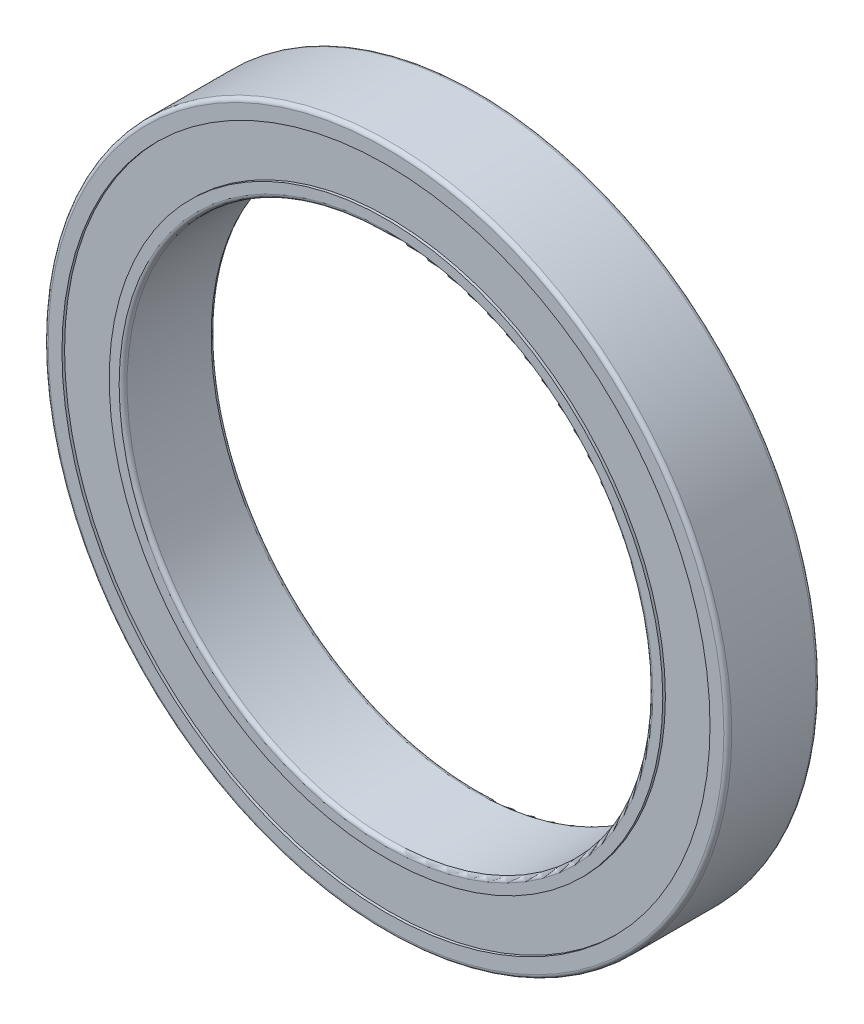
ISO-10303-21;
HEADER;
FILE_DESCRIPTION(('STEP AP214'),'2;1');
FILE_NAME('part.step','',(''),(''),'','','');
FILE_SCHEMA(('AUTOMOTIVE_DESIGN { 1 0 10303 214 1 1 1 1 }'));
ENDSEC;
DATA;
#1=APPLICATION_CONTEXT('core data for automotive mechanical design processes');
#2=APPLICATION_PROTOCOL_DEFINITION('international standard','automotive_design',2000,#1);
#3=PRODUCT_CONTEXT('',#1,'mechanical');
#4=PRODUCT('Part','Part','',(#3));
#5=PRODUCT_RELATED_PRODUCT_CATEGORY('part','',(#4));
#6=PRODUCT_DEFINITION_FORMATION('','',#4);
#7=PRODUCT_DEFINITION_CONTEXT('part definition',#1,'design');
#8=PRODUCT_DEFINITION('design','',#6,#7);
#9=PRODUCT_DEFINITION_SHAPE('','',#8);
#10=(LENGTH_UNIT() NAMED_UNIT(*) SI_UNIT(.MILLI.,.METRE.));
#11=(NAMED_UNIT(*) PLANE_ANGLE_UNIT() SI_UNIT($,.RADIAN.));
#12=(NAMED_UNIT(*) SI_UNIT($,.STERADIAN.) SOLID_ANGLE_UNIT());
#13=UNCERTAINTY_MEASURE_WITH_UNIT(LENGTH_MEASURE(1.E-05),#10,'distance_accuracy_value','');
#14=(GEOMETRIC_REPRESENTATION_CONTEXT(3) GLOBAL_UNCERTAINTY_ASSIGNED_CONTEXT((#13)) GLOBAL_UNIT_ASSIGNED_CONTEXT((#10,
#11,#12)) REPRESENTATION_CONTEXT('',''));
#15=CARTESIAN_POINT('',(0.,0.,0.));
#16=DIRECTION('',(0.,0.,1.));
#17=DIRECTION('',(1.,0.,0.));
#18=AXIS2_PLACEMENT_3D('',#15,#16,#17);
#19=CARTESIAN_POINT('',(0.,0.,-3.35925506265154));
#20=DIRECTION('',(0.,0.,1.));
#21=DIRECTION('',(1.,0.,0.));
#22=AXIS2_PLACEMENT_3D('',#19,#20,#21);
#23=PLANE('',#22);
#24=CARTESIAN_POINT('',(0.,0.,-3.35925506265154));
#25=DIRECTION('',(0.,0.,1.));
#26=DIRECTION('',(1.,0.,0.));
#27=AXIS2_PLACEMENT_3D('',#24,#25,#26);
#28=CIRCLE('',#27,25.7);
#29=CARTESIAN_POINT('',(25.7,0.,-3.35925506265154));
#30=VERTEX_POINT('',#29);
#31=EDGE_CURVE('E10',#30,#30,#28,.T.);
#32=ORIENTED_EDGE('',*,*,#31,.F.);
#33=EDGE_LOOP('',(#32));
#34=FACE_BOUND('',#33,.T.);
#35=CARTESIAN_POINT('',(0.,0.,-3.35925506265154));
#36=DIRECTION('',(0.,0.,1.));
#37=DIRECTION('',(1.,0.,0.));
#38=AXIS2_PLACEMENT_3D('',#35,#36,#37);
#39=CIRCLE('',#38,24.650000054);
#40=CARTESIAN_POINT('',(24.650000054,0.,-3.35925506265154));
#41=VERTEX_POINT('',#40);
#42=EDGE_CURVE('E83',#41,#41,#39,.T.);
#43=ORIENTED_EDGE('',*,*,#42,.T.);
#44=EDGE_LOOP('',(#43));
#45=FACE_BOUND('',#44,.T.);
#46=ADVANCED_FACE('F30',(#34,#45),#23,.F.);
#47=CARTESIAN_POINT('',(0.,0.,-3.05925506265154));
#48=DIRECTION('',(0.,0.,1.));
#49=DIRECTION('',(1.,0.,0.));
#50=AXIS2_PLACEMENT_3D('',#47,#48,#49);
#51=TOROIDAL_SURFACE('',#50,25.7,0.299999999999999);
#52=CARTESIAN_POINT('',(0.,0.,-3.05925506265154));
#53=DIRECTION('',(0.,0.,1.));
#54=DIRECTION('',(1.,0.,0.));
#55=AXIS2_PLACEMENT_3D('',#52,#53,#54);
#56=CIRCLE('',#55,26.);
#57=CARTESIAN_POINT('',(26.,0.,-3.05925506265154));
#58=VERTEX_POINT('',#57);
#59=EDGE_CURVE('E37',#58,#58,#56,.T.);
#60=ORIENTED_EDGE('',*,*,#59,.F.);
#61=EDGE_LOOP('',(#60));
#62=FACE_BOUND('',#61,.T.);
#63=ORIENTED_EDGE('',*,*,#31,.T.);
#64=EDGE_LOOP('',(#63));
#65=FACE_BOUND('',#64,.T.);
#66=ADVANCED_FACE('F32',(#62,#65),#51,.T.);
#67=CARTESIAN_POINT('',(0.,0.,0.));
#68=DIRECTION('',(0.,0.,1.));
#69=DIRECTION('',(1.,0.,0.));
#70=AXIS2_PLACEMENT_3D('',#67,#68,#69);
#71=CYLINDRICAL_SURFACE('',#70,26.);
#72=ORIENTED_EDGE('',*,*,#59,.T.);
#73=EDGE_LOOP('',(#72));
#74=FACE_BOUND('',#73,.T.);
#75=CARTESIAN_POINT('',(0.,0.,3.34074493734846));
#76=DIRECTION('',(0.,0.,1.));
#77=DIRECTION('',(1.,0.,0.));
#78=AXIS2_PLACEMENT_3D('',#75,#76,#77);
#79=CIRCLE('',#78,26.);
#80=CARTESIAN_POINT('',(26.,0.,3.34074493734846));
#81=VERTEX_POINT('',#80);
#82=EDGE_CURVE('E41',#81,#81,#79,.T.);
#83=ORIENTED_EDGE('',*,*,#82,.F.);
#84=EDGE_LOOP('',(#83));
#85=FACE_BOUND('',#84,.T.);
#86=ADVANCED_FACE('F106',(#74,#85),#71,.T.);
#87=CARTESIAN_POINT('',(0.,0.,3.34074493734846));
#88=DIRECTION('',(0.,0.,1.));
#89=DIRECTION('',(1.,0.,0.));
#90=AXIS2_PLACEMENT_3D('',#87,#88,#89);
#91=TOROIDAL_SURFACE('',#90,25.7,0.300000000000001);
#92=CARTESIAN_POINT('',(0.,0.,3.64074493734846));
#93=DIRECTION('',(0.,0.,1.));
#94=DIRECTION('',(1.,0.,0.));
#95=AXIS2_PLACEMENT_3D('',#92,#93,#94);
#96=CIRCLE('',#95,25.7);
#97=CARTESIAN_POINT('',(25.7,0.,3.64074493734846));
#98=VERTEX_POINT('',#97);
#99=EDGE_CURVE('E45',#98,#98,#96,.T.);
#100=ORIENTED_EDGE('',*,*,#99,.F.);
#101=EDGE_LOOP('',(#100));
#102=FACE_BOUND('',#101,.T.);
#103=ORIENTED_EDGE('',*,*,#82,.T.);
#104=EDGE_LOOP('',(#103));
#105=FACE_BOUND('',#104,.T.);
#106=ADVANCED_FACE('F152',(#102,#105),#91,.T.);
#107=CARTESIAN_POINT('',(0.,0.,3.64074493734846));
#108=DIRECTION('',(0.,0.,1.));
#109=DIRECTION('',(1.,0.,0.));
#110=AXIS2_PLACEMENT_3D('',#107,#108,#109);
#111=PLANE('',#110);
#112=ORIENTED_EDGE('',*,*,#99,.T.);
#113=EDGE_LOOP('',(#112));
#114=FACE_BOUND('',#113,.T.);
#115=CARTESIAN_POINT('',(0.,0.,3.64074493734846));
#116=DIRECTION('',(0.,0.,1.));
#117=DIRECTION('',(1.,0.,0.));
#118=AXIS2_PLACEMENT_3D('',#115,#116,#117);
#119=CIRCLE('',#118,24.650000054);
#120=CARTESIAN_POINT('',(24.650000054,0.,3.64074493734846));
#121=VERTEX_POINT('',#120);
#122=EDGE_CURVE('E50',#121,#121,#119,.T.);
#123=ORIENTED_EDGE('',*,*,#122,.F.);
#124=EDGE_LOOP('',(#123));
#125=FACE_BOUND('',#124,.T.);
#126=ADVANCED_FACE('F140',(#114,#125),#111,.T.);
#127=CARTESIAN_POINT('',(0.,0.,0.));
#128=DIRECTION('',(0.,0.,1.));
#129=DIRECTION('',(1.,0.,0.));
#130=AXIS2_PLACEMENT_3D('',#127,#128,#129);
#131=CYLINDRICAL_SURFACE('',#130,24.650000054);
#132=CARTESIAN_POINT('',(0.,0.,3.44074493734846));
#133=DIRECTION('',(0.,0.,1.));
#134=DIRECTION('',(1.,0.,0.));
#135=AXIS2_PLACEMENT_3D('',#132,#133,#134);
#136=CIRCLE('',#135,24.650000054);
#137=CARTESIAN_POINT('',(24.650000054,0.,3.44074493734846));
#138=VERTEX_POINT('',#137);
#139=EDGE_CURVE('E53',#138,#138,#136,.T.);
#140=ORIENTED_EDGE('',*,*,#139,.F.);
#141=EDGE_LOOP('',(#140));
#142=FACE_BOUND('',#141,.T.);
#143=ORIENTED_EDGE('',*,*,#122,.T.);
#144=EDGE_LOOP('',(#143));
#145=FACE_BOUND('',#144,.T.);
#146=ADVANCED_FACE('F147',(#142,#145),#131,.F.);
#147=CARTESIAN_POINT('',(0.,0.,3.44074493734846));
#148=DIRECTION('',(0.,0.,-1.));
#149=DIRECTION('',(-1.,0.,0.));
#150=AXIS2_PLACEMENT_3D('',#147,#148,#149);
#151=PLANE('',#150);
#152=CARTESIAN_POINT('',(0.,0.,3.44074493734846));
#153=DIRECTION('',(0.,0.,1.));
#154=DIRECTION('',(1.,0.,0.));
#155=AXIS2_PLACEMENT_3D('',#152,#153,#154);
#156=CIRCLE('',#155,21.055000054);
#157=CARTESIAN_POINT('',(21.055000054,0.,3.44074493734846));
#158=VERTEX_POINT('',#157);
#159=EDGE_CURVE('E56',#158,#158,#156,.T.);
#160=ORIENTED_EDGE('',*,*,#159,.F.);
#161=EDGE_LOOP('',(#160));
#162=FACE_BOUND('',#161,.T.);
#163=ORIENTED_EDGE('',*,*,#139,.T.);
#164=EDGE_LOOP('',(#163));
#165=FACE_BOUND('',#164,.T.);
#166=ADVANCED_FACE('F143',(#162,#165),#151,.F.);
#167=CARTESIAN_POINT('',(0.,0.,0.));
#168=DIRECTION('',(0.,0.,1.));
#169=DIRECTION('',(1.,0.,0.));
#170=AXIS2_PLACEMENT_3D('',#167,#168,#169);
#171=CYLINDRICAL_SURFACE('',#170,21.055000054);
#172=ORIENTED_EDGE('',*,*,#159,.T.);
#173=EDGE_LOOP('',(#172));
#174=FACE_BOUND('',#173,.T.);
#175=CARTESIAN_POINT('',(0.,0.,3.64074493734846));
#176=DIRECTION('',(0.,0.,1.));
#177=DIRECTION('',(1.,0.,0.));
#178=AXIS2_PLACEMENT_3D('',#175,#176,#177);
#179=CIRCLE('',#178,21.055000054);
#180=CARTESIAN_POINT('',(21.055000054,0.,3.64074493734846));
#181=VERTEX_POINT('',#180);
#182=EDGE_CURVE('E59',#181,#181,#179,.T.);
#183=ORIENTED_EDGE('',*,*,#182,.F.);
#184=EDGE_LOOP('',(#183));
#185=FACE_BOUND('',#184,.T.);
#186=ADVANCED_FACE('F138',(#174,#185),#171,.T.);
#187=ORIENTED_EDGE('',*,*,#182,.T.);
#188=EDGE_LOOP('',(#187));
#189=FACE_BOUND('',#188,.T.);
#190=CARTESIAN_POINT('',(0.,0.,3.64074493734846));
#191=DIRECTION('',(0.,0.,1.));
#192=DIRECTION('',(1.,0.,0.));
#193=AXIS2_PLACEMENT_3D('',#190,#191,#192);
#194=CIRCLE('',#193,20.3);
#195=CARTESIAN_POINT('',(20.3,0.,3.64074493734846));
#196=VERTEX_POINT('',#195);
#197=EDGE_CURVE('E62',#196,#196,#194,.T.);
#198=ORIENTED_EDGE('',*,*,#197,.F.);
#199=EDGE_LOOP('',(#198));
#200=FACE_BOUND('',#199,.T.);
#201=ADVANCED_FACE('F134',(#189,#200),#111,.T.);
#202=CARTESIAN_POINT('',(0.,0.,3.34074493734846));
#203=DIRECTION('',(0.,0.,1.));
#204=DIRECTION('',(1.,0.,0.));
#205=AXIS2_PLACEMENT_3D('',#202,#203,#204);
#206=TOROIDAL_SURFACE('',#205,20.3,0.300000000000001);
#207=CARTESIAN_POINT('',(0.,0.,3.34074493734846));
#208=DIRECTION('',(0.,0.,1.));
#209=DIRECTION('',(1.,0.,0.));
#210=AXIS2_PLACEMENT_3D('',#207,#208,#209);
#211=CIRCLE('',#210,20.);
#212=CARTESIAN_POINT('',(20.,0.,3.34074493734846));
#213=VERTEX_POINT('',#212);
#214=EDGE_CURVE('E65',#213,#213,#211,.T.);
#215=ORIENTED_EDGE('',*,*,#214,.F.);
#216=EDGE_LOOP('',(#215));
#217=FACE_BOUND('',#216,.T.);
#218=ORIENTED_EDGE('',*,*,#197,.T.);
#219=EDGE_LOOP('',(#218));
#220=FACE_BOUND('',#219,.T.);
#221=ADVANCED_FACE('F128',(#217,#220),#206,.T.);
#222=CARTESIAN_POINT('',(0.,0.,0.));
#223=DIRECTION('',(0.,0.,1.));
#224=DIRECTION('',(1.,0.,0.));
#225=AXIS2_PLACEMENT_3D('',#222,#223,#224);
#226=CYLINDRICAL_SURFACE('',#225,20.);
#227=CARTESIAN_POINT('',(0.,0.,-3.05925506265154));
#228=DIRECTION('',(0.,0.,1.));
#229=DIRECTION('',(1.,0.,0.));
#230=AXIS2_PLACEMENT_3D('',#227,#228,#229);
#231=CIRCLE('',#230,20.);
#232=CARTESIAN_POINT('',(20.,0.,-3.05925506265154));
#233=VERTEX_POINT('',#232);
#234=EDGE_CURVE('E68',#233,#233,#231,.T.);
#235=ORIENTED_EDGE('',*,*,#234,.F.);
#236=EDGE_LOOP('',(#235));
#237=FACE_BOUND('',#236,.T.);
#238=ORIENTED_EDGE('',*,*,#214,.T.);
#239=EDGE_LOOP('',(#238));
#240=FACE_BOUND('',#239,.T.);
#241=ADVANCED_FACE('F118',(#237,#240),#226,.F.);
#242=CARTESIAN_POINT('',(0.,0.,-3.05925506265154));
#243=DIRECTION('',(0.,0.,1.));
#244=DIRECTION('',(1.,0.,0.));
#245=AXIS2_PLACEMENT_3D('',#242,#243,#244);
#246=TOROIDAL_SURFACE('',#245,20.3,0.300000000000001);
#247=ORIENTED_EDGE('',*,*,#234,.T.);
#248=EDGE_LOOP('',(#247));
#249=FACE_BOUND('',#248,.T.);
#250=CARTESIAN_POINT('',(0.,0.,-3.35925506265154));
#251=DIRECTION('',(0.,0.,1.));
#252=DIRECTION('',(1.,0.,0.));
#253=AXIS2_PLACEMENT_3D('',#250,#251,#252);
#254=CIRCLE('',#253,20.3);
#255=CARTESIAN_POINT('',(20.3,0.,-3.35925506265154));
#256=VERTEX_POINT('',#255);
#257=EDGE_CURVE('E71',#256,#256,#254,.T.);
#258=ORIENTED_EDGE('',*,*,#257,.F.);
#259=EDGE_LOOP('',(#258));
#260=FACE_BOUND('',#259,.T.);
#261=ADVANCED_FACE('F111',(#249,#260),#246,.T.);
#262=CARTESIAN_POINT('',(0.,0.,-3.35925506265154));
#263=DIRECTION('',(0.,0.,1.));
#264=DIRECTION('',(1.,0.,0.));
#265=AXIS2_PLACEMENT_3D('',#262,#263,#264);
#266=CIRCLE('',#265,21.055000054);
#267=CARTESIAN_POINT('',(21.055000054,0.,-3.35925506265154));
#268=VERTEX_POINT('',#267);
#269=EDGE_CURVE('E74',#268,#268,#266,.T.);
#270=ORIENTED_EDGE('',*,*,#269,.F.);
#271=EDGE_LOOP('',(#270));
#272=FACE_BOUND('',#271,.T.);
#273=ORIENTED_EDGE('',*,*,#257,.T.);
#274=EDGE_LOOP('',(#273));
#275=FACE_BOUND('',#274,.T.);
#276=ADVANCED_FACE('F102',(#272,#275),#23,.F.);
#277=CARTESIAN_POINT('',(0.,0.,0.));
#278=DIRECTION('',(0.,0.,1.));
#279=DIRECTION('',(1.,0.,0.));
#280=AXIS2_PLACEMENT_3D('',#277,#278,#279);
#281=CYLINDRICAL_SURFACE('',#280,21.055000054);
#282=CARTESIAN_POINT('',(0.,0.,-3.15925506265154));
#283=DIRECTION('',(0.,0.,1.));
#284=DIRECTION('',(1.,0.,0.));
#285=AXIS2_PLACEMENT_3D('',#282,#283,#284);
#286=CIRCLE('',#285,21.055000054);
#287=CARTESIAN_POINT('',(21.055000054,0.,-3.15925506265154));
#288=VERTEX_POINT('',#287);
#289=EDGE_CURVE('E77',#288,#288,#286,.T.);
#290=ORIENTED_EDGE('',*,*,#289,.F.);
#291=EDGE_LOOP('',(#290));
#292=FACE_BOUND('',#291,.T.);
#293=ORIENTED_EDGE('',*,*,#269,.T.);
#294=EDGE_LOOP('',(#293));
#295=FACE_BOUND('',#294,.T.);
#296=ADVANCED_FACE('F96',(#292,#295),#281,.T.);
#297=CARTESIAN_POINT('',(0.,0.,-3.15925506265154));
#298=DIRECTION('',(0.,0.,-1.));
#299=DIRECTION('',(-1.,0.,0.));
#300=AXIS2_PLACEMENT_3D('',#297,#298,#299);
#301=PLANE('',#300);
#302=ORIENTED_EDGE('',*,*,#289,.T.);
#303=EDGE_LOOP('',(#302));
#304=FACE_BOUND('',#303,.T.);
#305=CARTESIAN_POINT('',(0.,0.,-3.15925506265154));
#306=DIRECTION('',(0.,0.,1.));
#307=DIRECTION('',(1.,0.,0.));
#308=AXIS2_PLACEMENT_3D('',#305,#306,#307);
#309=CIRCLE('',#308,24.650000054);
#310=CARTESIAN_POINT('',(24.650000054,0.,-3.15925506265154));
#311=VERTEX_POINT('',#310);
#312=EDGE_CURVE('E80',#311,#311,#309,.T.);
#313=ORIENTED_EDGE('',*,*,#312,.F.);
#314=EDGE_LOOP('',(#313));
#315=FACE_BOUND('',#314,.T.);
#316=ADVANCED_FACE('F90',(#304,#315),#301,.T.);
#317=CARTESIAN_POINT('',(0.,0.,0.));
#318=DIRECTION('',(0.,0.,1.));
#319=DIRECTION('',(1.,0.,0.));
#320=AXIS2_PLACEMENT_3D('',#317,#318,#319);
#321=CYLINDRICAL_SURFACE('',#320,24.650000054);
#322=ORIENTED_EDGE('',*,*,#312,.T.);
#323=EDGE_LOOP('',(#322));
#324=FACE_BOUND('',#323,.T.);
#325=ORIENTED_EDGE('',*,*,#42,.F.);
#326=EDGE_LOOP('',(#325));
#327=FACE_BOUND('',#326,.T.);
#328=ADVANCED_FACE('F88',(#324,#327),#321,.F.);
#329=CLOSED_SHELL('',(#46,#66,#86,#106,#126,#146,#166,#186,#201,#221,#241,#261,#276,#296,#316,#328));
#330=MANIFOLD_SOLID_BREP('B2',#329);
#331=ADVANCED_BREP_SHAPE_REPRESENTATION('',(#18,#330),#14);
#332=SHAPE_DEFINITION_REPRESENTATION(#9,#331);
ENDSEC;
END-ISO-10303-21;
